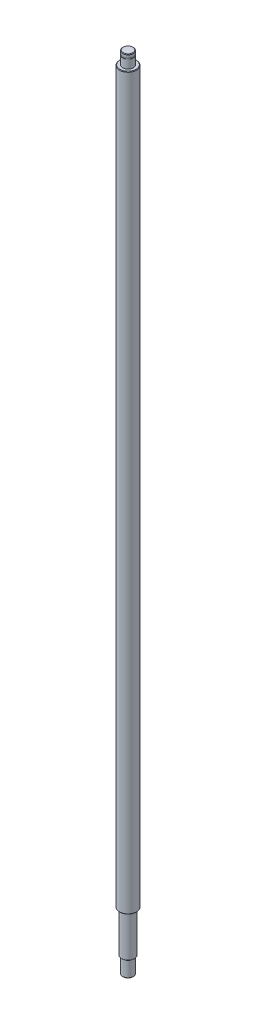
ISO-10303-21;
HEADER;
FILE_DESCRIPTION(('STEP AP214'),'2;1');
FILE_NAME('part.step','',(''),(''),'','','');
FILE_SCHEMA(('AUTOMOTIVE_DESIGN { 1 0 10303 214 1 1 1 1 }'));
ENDSEC;
DATA;
#1=APPLICATION_CONTEXT('core data for automotive mechanical design processes');
#2=APPLICATION_PROTOCOL_DEFINITION('international standard','automotive_design',2000,#1);
#3=PRODUCT_CONTEXT('',#1,'mechanical');
#4=PRODUCT('Part','Part','',(#3));
#5=PRODUCT_RELATED_PRODUCT_CATEGORY('part','',(#4));
#6=PRODUCT_DEFINITION_FORMATION('','',#4);
#7=PRODUCT_DEFINITION_CONTEXT('part definition',#1,'design');
#8=PRODUCT_DEFINITION('design','',#6,#7);
#9=PRODUCT_DEFINITION_SHAPE('','',#8);
#10=(LENGTH_UNIT() NAMED_UNIT(*) SI_UNIT(.MILLI.,.METRE.));
#11=(NAMED_UNIT(*) PLANE_ANGLE_UNIT() SI_UNIT($,.RADIAN.));
#12=(NAMED_UNIT(*) SI_UNIT($,.STERADIAN.) SOLID_ANGLE_UNIT());
#13=UNCERTAINTY_MEASURE_WITH_UNIT(LENGTH_MEASURE(1.E-05),#10,'distance_accuracy_value','');
#14=(GEOMETRIC_REPRESENTATION_CONTEXT(3) GLOBAL_UNCERTAINTY_ASSIGNED_CONTEXT((#13)) GLOBAL_UNIT_ASSIGNED_CONTEXT((#10,
#11,#12)) REPRESENTATION_CONTEXT('',''));
#15=CARTESIAN_POINT('',(0.,0.,0.));
#16=DIRECTION('',(0.,0.,1.));
#17=DIRECTION('',(1.,0.,0.));
#18=AXIS2_PLACEMENT_3D('',#15,#16,#17);
#19=CARTESIAN_POINT('',(0.,0.,0.));
#20=DIRECTION('',(0.,-1.,0.));
#21=DIRECTION('',(1.,0.,0.));
#22=AXIS2_PLACEMENT_3D('',#19,#20,#21);
#23=PLANE('',#22);
#24=CARTESIAN_POINT('',(0.,0.,0.));
#25=DIRECTION('',(0.,-1.,0.));
#26=DIRECTION('',(1.,0.,0.));
#27=AXIS2_PLACEMENT_3D('',#24,#25,#26);
#28=CIRCLE('',#27,4.49999999999995);
#29=CARTESIAN_POINT('',(4.49999999999995,0.,0.));
#30=VERTEX_POINT('',#29);
#31=EDGE_CURVE('E63',#30,#30,#28,.T.);
#32=ORIENTED_EDGE('',*,*,#31,.T.);
#33=EDGE_LOOP('',(#32));
#34=FACE_BOUND('',#33,.T.);
#35=ADVANCED_FACE('F37',(#34),#23,.T.);
#36=CARTESIAN_POINT('',(-1.40834381901946E-13,750.,0.));
#37=DIRECTION('',(0.,1.,0.));
#38=DIRECTION('',(-1.,0.,0.));
#39=AXIS2_PLACEMENT_3D('',#36,#37,#38);
#40=CYLINDRICAL_SURFACE('',#39,4.99999999999992);
#41=CARTESIAN_POINT('',(0.,0.499999999999945,0.));
#42=DIRECTION('',(0.,-1.,0.));
#43=DIRECTION('',(1.,0.,0.));
#44=AXIS2_PLACEMENT_3D('',#41,#42,#43);
#45=CIRCLE('',#44,4.99999999999992);
#46=CARTESIAN_POINT('',(4.99999999999992,0.499999999999946,0.));
#47=VERTEX_POINT('',#46);
#48=EDGE_CURVE('E66',#47,#47,#45,.F.);
#49=ORIENTED_EDGE('',*,*,#48,.T.);
#50=EDGE_LOOP('',(#49));
#51=FACE_BOUND('',#50,.T.);
#52=CARTESIAN_POINT('',(0.,15.,0.));
#53=DIRECTION('',(0.,1.,0.));
#54=DIRECTION('',(-1.,0.,0.));
#55=AXIS2_PLACEMENT_3D('',#52,#53,#54);
#56=CIRCLE('',#55,4.99999999999992);
#57=CARTESIAN_POINT('',(-4.99999999999992,15.,0.));
#58=VERTEX_POINT('',#57);
#59=EDGE_CURVE('E75',#58,#58,#56,.T.);
#60=ORIENTED_EDGE('',*,*,#59,.F.);
#61=EDGE_LOOP('',(#60));
#62=FACE_BOUND('',#61,.T.);
#63=ADVANCED_FACE('F115',(#51,#62),#40,.T.);
#64=CARTESIAN_POINT('',(-4.99999999999992,15.,0.));
#65=DIRECTION('',(0.,-1.,0.));
#66=DIRECTION('',(1.,0.,0.));
#67=AXIS2_PLACEMENT_3D('',#64,#65,#66);
#68=PLANE('',#67);
#69=CARTESIAN_POINT('',(0.,15.,0.));
#70=DIRECTION('',(0.,-1.,0.));
#71=DIRECTION('',(1.,0.,0.));
#72=AXIS2_PLACEMENT_3D('',#69,#70,#71);
#73=CIRCLE('',#72,5.49999999999982);
#74=CARTESIAN_POINT('',(5.49999999999982,15.,0.));
#75=VERTEX_POINT('',#74);
#76=EDGE_CURVE('E57',#75,#75,#73,.T.);
#77=ORIENTED_EDGE('',*,*,#76,.T.);
#78=EDGE_LOOP('',(#77));
#79=FACE_BOUND('',#78,.T.);
#80=ORIENTED_EDGE('',*,*,#59,.T.);
#81=EDGE_LOOP('',(#80));
#82=FACE_BOUND('',#81,.T.);
#83=ADVANCED_FACE('F121',(#79,#82),#68,.T.);
#84=CARTESIAN_POINT('',(-1.40834381901946E-13,750.,0.));
#85=DIRECTION('',(0.,1.,0.));
#86=DIRECTION('',(-1.,0.,0.));
#87=AXIS2_PLACEMENT_3D('',#84,#85,#86);
#88=CYLINDRICAL_SURFACE('',#87,5.99999999999993);
#89=CARTESIAN_POINT('',(0.,15.5,0.));
#90=DIRECTION('',(0.,-1.,0.));
#91=DIRECTION('',(1.,0.,0.));
#92=AXIS2_PLACEMENT_3D('',#89,#90,#91);
#93=CIRCLE('',#92,5.99999999999993);
#94=CARTESIAN_POINT('',(5.99999999999993,15.5,0.));
#95=VERTEX_POINT('',#94);
#96=EDGE_CURVE('E60',#95,#95,#93,.F.);
#97=ORIENTED_EDGE('',*,*,#96,.T.);
#98=EDGE_LOOP('',(#97));
#99=FACE_BOUND('',#98,.T.);
#100=CARTESIAN_POINT('',(0.,54.,0.));
#101=DIRECTION('',(0.,1.,0.));
#102=DIRECTION('',(-1.,0.,0.));
#103=AXIS2_PLACEMENT_3D('',#100,#101,#102);
#104=CIRCLE('',#103,5.99999999999995);
#105=CARTESIAN_POINT('',(-5.99999999999996,54.,0.));
#106=VERTEX_POINT('',#105);
#107=EDGE_CURVE('E78',#106,#106,#104,.T.);
#108=ORIENTED_EDGE('',*,*,#107,.F.);
#109=EDGE_LOOP('',(#108));
#110=FACE_BOUND('',#109,.T.);
#111=ADVANCED_FACE('F161',(#99,#110),#88,.T.);
#112=CARTESIAN_POINT('',(-5.99999999999996,54.,0.));
#113=DIRECTION('',(0.,-1.,0.));
#114=DIRECTION('',(1.,0.,0.));
#115=AXIS2_PLACEMENT_3D('',#112,#113,#114);
#116=PLANE('',#115);
#117=CARTESIAN_POINT('',(0.,54.,0.));
#118=DIRECTION('',(0.,-1.,0.));
#119=DIRECTION('',(1.,0.,0.));
#120=AXIS2_PLACEMENT_3D('',#117,#118,#119);
#121=CIRCLE('',#120,7.50000000000001);
#122=CARTESIAN_POINT('',(7.5,54.,0.));
#123=VERTEX_POINT('',#122);
#124=EDGE_CURVE('E44',#123,#123,#121,.T.);
#125=ORIENTED_EDGE('',*,*,#124,.T.);
#126=EDGE_LOOP('',(#125));
#127=FACE_BOUND('',#126,.T.);
#128=ORIENTED_EDGE('',*,*,#107,.T.);
#129=EDGE_LOOP('',(#128));
#130=FACE_BOUND('',#129,.T.);
#131=ADVANCED_FACE('F151',(#127,#130),#116,.T.);
#132=CARTESIAN_POINT('',(-1.40834381901946E-13,750.,0.));
#133=DIRECTION('',(0.,1.,0.));
#134=DIRECTION('',(-1.,0.,0.));
#135=AXIS2_PLACEMENT_3D('',#132,#133,#134);
#136=CYLINDRICAL_SURFACE('',#135,7.99999999999989);
#137=CARTESIAN_POINT('',(0.,54.5,0.));
#138=DIRECTION('',(0.,-1.,0.));
#139=DIRECTION('',(1.,0.,0.));
#140=AXIS2_PLACEMENT_3D('',#137,#138,#139);
#141=CIRCLE('',#140,7.99999999999989);
#142=CARTESIAN_POINT('',(7.99999999999988,54.5,0.));
#143=VERTEX_POINT('',#142);
#144=EDGE_CURVE('E48',#143,#143,#141,.F.);
#145=ORIENTED_EDGE('',*,*,#144,.T.);
#146=EDGE_LOOP('',(#145));
#147=FACE_BOUND('',#146,.T.);
#148=CARTESIAN_POINT('',(-1.3848714220358E-13,737.5,0.));
#149=DIRECTION('',(0.,1.,0.));
#150=DIRECTION('',(-1.,0.,0.));
#151=AXIS2_PLACEMENT_3D('',#148,#149,#150);
#152=CIRCLE('',#151,7.99999999999989);
#153=CARTESIAN_POINT('',(-8.00000000000003,737.5,0.));
#154=VERTEX_POINT('',#153);
#155=EDGE_CURVE('E52',#154,#154,#152,.F.);
#156=ORIENTED_EDGE('',*,*,#155,.T.);
#157=EDGE_LOOP('',(#156));
#158=FACE_BOUND('',#157,.T.);
#159=ADVANCED_FACE('F147',(#147,#158),#136,.T.);
#160=CARTESIAN_POINT('',(-7.99999999999996,738.,0.));
#161=DIRECTION('',(0.,1.,0.));
#162=DIRECTION('',(-1.,0.,0.));
#163=AXIS2_PLACEMENT_3D('',#160,#161,#162);
#164=PLANE('',#163);
#165=CARTESIAN_POINT('',(-1.38581031791514E-13,738.,0.));
#166=DIRECTION('',(0.,1.,0.));
#167=DIRECTION('',(-1.,0.,0.));
#168=AXIS2_PLACEMENT_3D('',#165,#166,#167);
#169=CIRCLE('',#168,7.49999999999991);
#170=CARTESIAN_POINT('',(-7.50000000000005,738.,0.));
#171=VERTEX_POINT('',#170);
#172=EDGE_CURVE('E10',#171,#171,#169,.T.);
#173=ORIENTED_EDGE('',*,*,#172,.T.);
#174=EDGE_LOOP('',(#173));
#175=FACE_BOUND('',#174,.T.);
#176=CARTESIAN_POINT('',(-1.38581031791514E-13,738.,0.));
#177=DIRECTION('',(0.,1.,0.));
#178=DIRECTION('',(-1.,0.,0.));
#179=AXIS2_PLACEMENT_3D('',#176,#177,#178);
#180=CIRCLE('',#179,4.99999999999992);
#181=CARTESIAN_POINT('',(-5.00000000000006,738.,0.));
#182=VERTEX_POINT('',#181);
#183=EDGE_CURVE('E81',#182,#182,#180,.T.);
#184=ORIENTED_EDGE('',*,*,#183,.F.);
#185=EDGE_LOOP('',(#184));
#186=FACE_BOUND('',#185,.T.);
#187=ADVANCED_FACE('F150',(#175,#186),#164,.T.);
#188=CARTESIAN_POINT('',(-1.40834381901946E-13,750.,0.));
#189=DIRECTION('',(0.,1.,0.));
#190=DIRECTION('',(-1.,0.,0.));
#191=AXIS2_PLACEMENT_3D('',#188,#189,#190);
#192=CYLINDRICAL_SURFACE('',#191,4.99999999999991);
#193=ORIENTED_EDGE('',*,*,#183,.T.);
#194=EDGE_LOOP('',(#193));
#195=FACE_BOUND('',#194,.T.);
#196=CARTESIAN_POINT('',(-1.40083265198469E-13,746.,0.));
#197=DIRECTION('',(0.,1.,0.));
#198=DIRECTION('',(-1.,0.,0.));
#199=AXIS2_PLACEMENT_3D('',#196,#197,#198);
#200=CIRCLE('',#199,4.99999999999991);
#201=CARTESIAN_POINT('',(-5.00000000000006,746.,0.));
#202=VERTEX_POINT('',#201);
#203=EDGE_CURVE('E84',#202,#202,#200,.T.);
#204=ORIENTED_EDGE('',*,*,#203,.F.);
#205=EDGE_LOOP('',(#204));
#206=FACE_BOUND('',#205,.T.);
#207=ADVANCED_FACE('F159',(#195,#206),#192,.T.);
#208=CARTESIAN_POINT('',(-5.00000000000006,746.,0.));
#209=DIRECTION('',(0.,1.,0.));
#210=DIRECTION('',(-1.,0.,0.));
#211=AXIS2_PLACEMENT_3D('',#208,#209,#210);
#212=PLANE('',#211);
#213=ORIENTED_EDGE('',*,*,#203,.T.);
#214=EDGE_LOOP('',(#213));
#215=FACE_BOUND('',#214,.T.);
#216=CARTESIAN_POINT('',(-1.40083265198469E-13,746.,0.));
#217=DIRECTION('',(0.,1.,0.));
#218=DIRECTION('',(-1.,0.,0.));
#219=AXIS2_PLACEMENT_3D('',#216,#217,#218);
#220=CIRCLE('',#219,4.79999999999997);
#221=CARTESIAN_POINT('',(-4.80000000000011,746.,0.));
#222=VERTEX_POINT('',#221);
#223=EDGE_CURVE('E87',#222,#222,#220,.T.);
#224=ORIENTED_EDGE('',*,*,#223,.F.);
#225=EDGE_LOOP('',(#224));
#226=FACE_BOUND('',#225,.T.);
#227=ADVANCED_FACE('F111',(#215,#226),#212,.T.);
#228=CARTESIAN_POINT('',(-1.40834381901946E-13,750.,0.));
#229=DIRECTION('',(0.,1.,0.));
#230=DIRECTION('',(-1.,0.,0.));
#231=AXIS2_PLACEMENT_3D('',#228,#229,#230);
#232=CYLINDRICAL_SURFACE('',#231,4.79999999999997);
#233=ORIENTED_EDGE('',*,*,#223,.T.);
#234=EDGE_LOOP('',(#233));
#235=FACE_BOUND('',#234,.T.);
#236=CARTESIAN_POINT('',(-1.40299211250718E-13,747.15,0.));
#237=DIRECTION('',(0.,1.,0.));
#238=DIRECTION('',(-1.,0.,0.));
#239=AXIS2_PLACEMENT_3D('',#236,#237,#238);
#240=CIRCLE('',#239,4.79999999999997);
#241=CARTESIAN_POINT('',(-4.80000000000011,747.15,0.));
#242=VERTEX_POINT('',#241);
#243=EDGE_CURVE('E90',#242,#242,#240,.T.);
#244=ORIENTED_EDGE('',*,*,#243,.F.);
#245=EDGE_LOOP('',(#244));
#246=FACE_BOUND('',#245,.T.);
#247=ADVANCED_FACE('F101',(#235,#246),#232,.T.);
#248=CARTESIAN_POINT('',(-4.80000000000011,747.15,0.));
#249=DIRECTION('',(0.,-1.,0.));
#250=DIRECTION('',(1.,0.,0.));
#251=AXIS2_PLACEMENT_3D('',#248,#249,#250);
#252=PLANE('',#251);
#253=ORIENTED_EDGE('',*,*,#243,.T.);
#254=EDGE_LOOP('',(#253));
#255=FACE_BOUND('',#254,.T.);
#256=CARTESIAN_POINT('',(-1.40299211250718E-13,747.15,0.));
#257=DIRECTION('',(0.,1.,0.));
#258=DIRECTION('',(-1.,0.,0.));
#259=AXIS2_PLACEMENT_3D('',#256,#257,#258);
#260=CIRCLE('',#259,4.99999999999991);
#261=CARTESIAN_POINT('',(-5.00000000000006,747.15,0.));
#262=VERTEX_POINT('',#261);
#263=EDGE_CURVE('E93',#262,#262,#260,.T.);
#264=ORIENTED_EDGE('',*,*,#263,.F.);
#265=EDGE_LOOP('',(#264));
#266=FACE_BOUND('',#265,.T.);
#267=ADVANCED_FACE('F99',(#255,#266),#252,.T.);
#268=CARTESIAN_POINT('',(-1.40834381901946E-13,750.,0.));
#269=DIRECTION('',(0.,1.,0.));
#270=DIRECTION('',(-1.,0.,0.));
#271=AXIS2_PLACEMENT_3D('',#268,#269,#270);
#272=CYLINDRICAL_SURFACE('',#271,4.99999999999991);
#273=CARTESIAN_POINT('',(-1.40740492314011E-13,749.5,0.));
#274=DIRECTION('',(0.,1.,0.));
#275=DIRECTION('',(-1.,0.,0.));
#276=AXIS2_PLACEMENT_3D('',#273,#274,#275);
#277=CIRCLE('',#276,4.99999999999991);
#278=CARTESIAN_POINT('',(-5.00000000000006,749.5,0.));
#279=VERTEX_POINT('',#278);
#280=EDGE_CURVE('E69',#279,#279,#277,.F.);
#281=ORIENTED_EDGE('',*,*,#280,.T.);
#282=EDGE_LOOP('',(#281));
#283=FACE_BOUND('',#282,.T.);
#284=ORIENTED_EDGE('',*,*,#263,.T.);
#285=EDGE_LOOP('',(#284));
#286=FACE_BOUND('',#285,.T.);
#287=ADVANCED_FACE('F97',(#283,#286),#272,.T.);
#288=CARTESIAN_POINT('',(-5.00000000000006,750.,0.));
#289=DIRECTION('',(0.,1.,0.));
#290=DIRECTION('',(-1.,0.,0.));
#291=AXIS2_PLACEMENT_3D('',#288,#289,#290);
#292=PLANE('',#291);
#293=CARTESIAN_POINT('',(-1.40834381901946E-13,750.,0.));
#294=DIRECTION('',(0.,1.,0.));
#295=DIRECTION('',(-1.,0.,0.));
#296=AXIS2_PLACEMENT_3D('',#293,#294,#295);
#297=CIRCLE('',#296,4.49999999999995);
#298=CARTESIAN_POINT('',(-4.50000000000009,750.,0.));
#299=VERTEX_POINT('',#298);
#300=EDGE_CURVE('E72',#299,#299,#297,.T.);
#301=ORIENTED_EDGE('',*,*,#300,.T.);
#302=EDGE_LOOP('',(#301));
#303=FACE_BOUND('',#302,.T.);
#304=ADVANCED_FACE('F108',(#303),#292,.T.);
#305=CARTESIAN_POINT('',(-1.40834381901946E-13,750.,0.));
#306=DIRECTION('',(0.,-1.,0.));
#307=DIRECTION('',(1.,0.,0.));
#308=AXIS2_PLACEMENT_3D('',#305,#306,#307);
#309=CONICAL_SURFACE('',#308,4.49999999999995,0.78539816339747);
#310=ORIENTED_EDGE('',*,*,#280,.F.);
#311=EDGE_LOOP('',(#310));
#312=FACE_BOUND('',#311,.T.);
#313=ORIENTED_EDGE('',*,*,#300,.F.);
#314=EDGE_LOOP('',(#313));
#315=FACE_BOUND('',#314,.T.);
#316=ADVANCED_FACE('F126',(#312,#315),#309,.T.);
#317=CARTESIAN_POINT('',(0.,0.499999999999945,0.));
#318=DIRECTION('',(0.,1.,0.));
#319=DIRECTION('',(-1.,0.,0.));
#320=AXIS2_PLACEMENT_3D('',#317,#318,#319);
#321=CONICAL_SURFACE('',#320,4.99999999999992,0.785398163397473);
#322=ORIENTED_EDGE('',*,*,#31,.F.);
#323=EDGE_LOOP('',(#322));
#324=FACE_BOUND('',#323,.T.);
#325=ORIENTED_EDGE('',*,*,#48,.F.);
#326=EDGE_LOOP('',(#325));
#327=FACE_BOUND('',#326,.T.);
#328=ADVANCED_FACE('F129',(#324,#327),#321,.T.);
#329=CARTESIAN_POINT('',(0.,15.5,0.));
#330=DIRECTION('',(0.,1.,0.));
#331=DIRECTION('',(-1.,0.,0.));
#332=AXIS2_PLACEMENT_3D('',#329,#330,#331);
#333=CONICAL_SURFACE('',#332,5.99999999999993,0.785398163397598);
#334=ORIENTED_EDGE('',*,*,#76,.F.);
#335=EDGE_LOOP('',(#334));
#336=FACE_BOUND('',#335,.T.);
#337=ORIENTED_EDGE('',*,*,#96,.F.);
#338=EDGE_LOOP('',(#337));
#339=FACE_BOUND('',#338,.T.);
#340=ADVANCED_FACE('F133',(#336,#339),#333,.T.);
#341=CARTESIAN_POINT('',(0.,54.5,0.));
#342=DIRECTION('',(0.,1.,0.));
#343=DIRECTION('',(-1.,0.,0.));
#344=AXIS2_PLACEMENT_3D('',#341,#342,#343);
#345=CONICAL_SURFACE('',#344,7.99999999999989,0.785398163397332);
#346=ORIENTED_EDGE('',*,*,#124,.F.);
#347=EDGE_LOOP('',(#346));
#348=FACE_BOUND('',#347,.T.);
#349=ORIENTED_EDGE('',*,*,#144,.F.);
#350=EDGE_LOOP('',(#349));
#351=FACE_BOUND('',#350,.T.);
#352=ADVANCED_FACE('F136',(#348,#351),#345,.T.);
#353=CARTESIAN_POINT('',(-1.38581031791514E-13,738.,0.));
#354=DIRECTION('',(0.,-1.,0.));
#355=DIRECTION('',(1.,0.,0.));
#356=AXIS2_PLACEMENT_3D('',#353,#354,#355);
#357=CONICAL_SURFACE('',#356,7.49999999999992,0.785398163397477);
#358=ORIENTED_EDGE('',*,*,#155,.F.);
#359=EDGE_LOOP('',(#358));
#360=FACE_BOUND('',#359,.T.);
#361=ORIENTED_EDGE('',*,*,#172,.F.);
#362=EDGE_LOOP('',(#361));
#363=FACE_BOUND('',#362,.T.);
#364=ADVANCED_FACE('F39',(#360,#363),#357,.T.);
#365=CLOSED_SHELL('',(#35,#63,#83,#111,#131,#159,#187,#207,#227,#247,#267,#287,#304,#316,#328,
#340,#352,#364));
#366=MANIFOLD_SOLID_BREP('B2',#365);
#367=ADVANCED_BREP_SHAPE_REPRESENTATION('',(#18,#366),#14);
#368=SHAPE_DEFINITION_REPRESENTATION(#9,#367);
ENDSEC;
END-ISO-10303-21;
